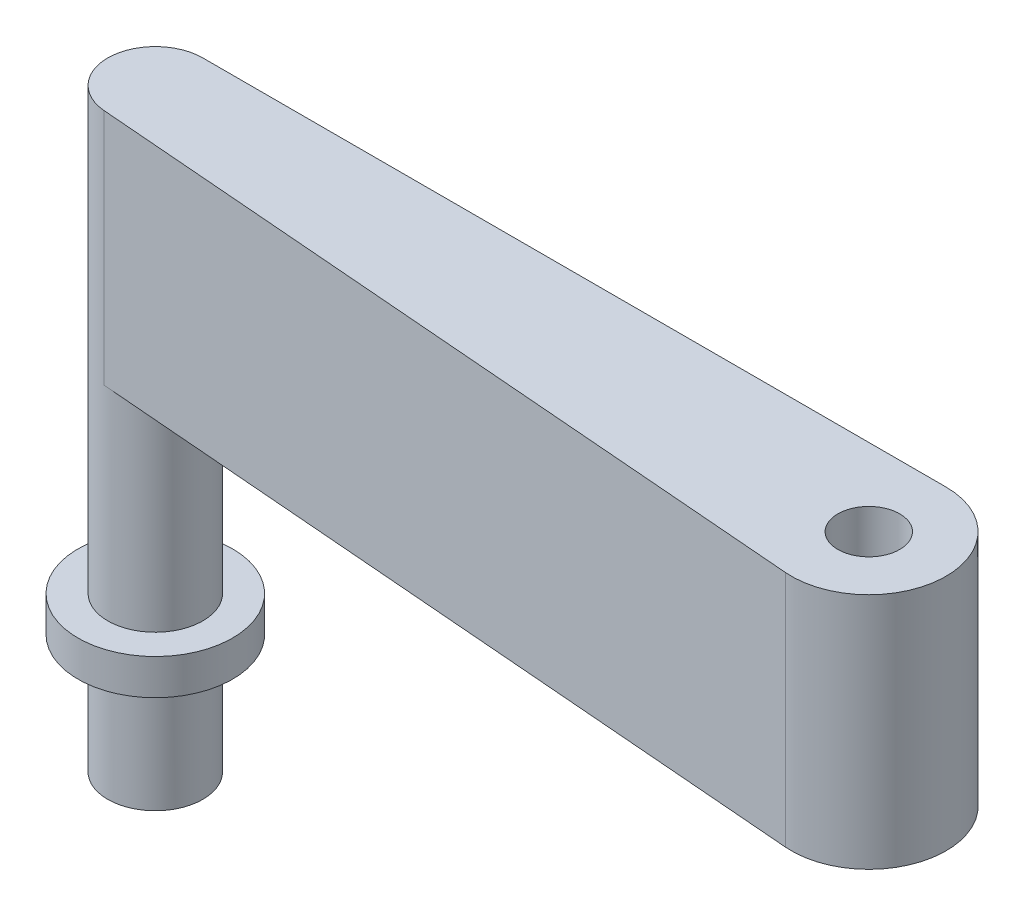
ISO-10303-21;
HEADER;
FILE_DESCRIPTION(('STEP AP214'),'2;1');
FILE_NAME('part.step','',(''),(''),'','','');
FILE_SCHEMA(('AUTOMOTIVE_DESIGN { 1 0 10303 214 1 1 1 1 }'));
ENDSEC;
DATA;
#1=APPLICATION_CONTEXT('core data for automotive mechanical design processes');
#2=APPLICATION_PROTOCOL_DEFINITION('international standard','automotive_design',2000,#1);
#3=PRODUCT_CONTEXT('',#1,'mechanical');
#4=PRODUCT('Part','Part','',(#3));
#5=PRODUCT_RELATED_PRODUCT_CATEGORY('part','',(#4));
#6=PRODUCT_DEFINITION_FORMATION('','',#4);
#7=PRODUCT_DEFINITION_CONTEXT('part definition',#1,'design');
#8=PRODUCT_DEFINITION('design','',#6,#7);
#9=PRODUCT_DEFINITION_SHAPE('','',#8);
#10=(LENGTH_UNIT() NAMED_UNIT(*) SI_UNIT(.MILLI.,.METRE.));
#11=(NAMED_UNIT(*) PLANE_ANGLE_UNIT() SI_UNIT($,.RADIAN.));
#12=(NAMED_UNIT(*) SI_UNIT($,.STERADIAN.) SOLID_ANGLE_UNIT());
#13=UNCERTAINTY_MEASURE_WITH_UNIT(LENGTH_MEASURE(1.E-05),#10,'distance_accuracy_value','');
#14=(GEOMETRIC_REPRESENTATION_CONTEXT(3) GLOBAL_UNCERTAINTY_ASSIGNED_CONTEXT((#13)) GLOBAL_UNIT_ASSIGNED_CONTEXT((#10,
#11,#12)) REPRESENTATION_CONTEXT('',''));
#15=CARTESIAN_POINT('',(0.,0.,0.));
#16=DIRECTION('',(0.,0.,1.));
#17=DIRECTION('',(1.,0.,0.));
#18=AXIS2_PLACEMENT_3D('',#15,#16,#17);
#19=CARTESIAN_POINT('',(-62.5,10.,-2.5));
#20=DIRECTION('',(0.,-1.,0.));
#21=DIRECTION('',(0.,0.,-1.));
#22=AXIS2_PLACEMENT_3D('',#19,#20,#21);
#23=CYLINDRICAL_SURFACE('',#22,4.);
#24=CARTESIAN_POINT('',(-62.5,-30.,-2.5));
#25=DIRECTION('',(0.,-1.,0.));
#26=DIRECTION('',(0.,0.,-1.));
#27=AXIS2_PLACEMENT_3D('',#24,#25,#26);
#28=CIRCLE('',#27,4.00000000000001);
#29=CARTESIAN_POINT('',(-62.5,-30.,-6.50000000000001));
#30=VERTEX_POINT('',#29);
#31=EDGE_CURVE('E134',#30,#30,#28,.T.);
#32=ORIENTED_EDGE('',*,*,#31,.T.);
#33=EDGE_LOOP('',(#32));
#34=FACE_BOUND('',#33,.T.);
#35=CARTESIAN_POINT('',(-62.5,-40.,-2.5));
#36=DIRECTION('',(0.,1.,0.));
#37=DIRECTION('',(0.,0.,1.));
#38=AXIS2_PLACEMENT_3D('',#35,#36,#37);
#39=CIRCLE('',#38,4.00000000000001);
#40=CARTESIAN_POINT('',(-62.5,-40.,1.50000000000001));
#41=VERTEX_POINT('',#40);
#42=EDGE_CURVE('E120',#41,#41,#39,.T.);
#43=ORIENTED_EDGE('',*,*,#42,.T.);
#44=EDGE_LOOP('',(#43));
#45=FACE_BOUND('',#44,.T.);
#46=ADVANCED_FACE('F35',(#34,#45),#23,.T.);
#47=CARTESIAN_POINT('',(-62.5,-40.,-2.5));
#48=DIRECTION('',(0.,1.,0.));
#49=DIRECTION('',(0.,0.,1.));
#50=AXIS2_PLACEMENT_3D('',#47,#48,#49);
#51=PLANE('',#50);
#52=CARTESIAN_POINT('',(-62.5,-40.,-2.5));
#53=DIRECTION('',(0.,-1.,0.));
#54=DIRECTION('',(0.,0.,-1.));
#55=AXIS2_PLACEMENT_3D('',#52,#53,#54);
#56=CIRCLE('',#55,2.59999999999999);
#57=CARTESIAN_POINT('',(-62.5,-40.,-5.09999999999999));
#58=VERTEX_POINT('',#57);
#59=EDGE_CURVE('E125',#58,#58,#56,.T.);
#60=ORIENTED_EDGE('',*,*,#59,.F.);
#61=EDGE_LOOP('',(#60));
#62=FACE_BOUND('',#61,.T.);
#63=ORIENTED_EDGE('',*,*,#42,.F.);
#64=EDGE_LOOP('',(#63));
#65=FACE_BOUND('',#64,.T.);
#66=ADVANCED_FACE('F159',(#62,#65),#51,.F.);
#67=CARTESIAN_POINT('',(-62.5,-30.,-2.5));
#68=DIRECTION('',(0.,-1.,0.));
#69=DIRECTION('',(0.,0.,-1.));
#70=AXIS2_PLACEMENT_3D('',#67,#68,#69);
#71=CYLINDRICAL_SURFACE('',#70,2.59999999999999);
#72=CARTESIAN_POINT('',(-62.5,-30.,-2.5));
#73=DIRECTION('',(0.,-1.,0.));
#74=DIRECTION('',(0.,0.,-1.));
#75=AXIS2_PLACEMENT_3D('',#72,#73,#74);
#76=CIRCLE('',#75,2.59999999999999);
#77=CARTESIAN_POINT('',(-62.5,-30.,-5.09999999999999));
#78=VERTEX_POINT('',#77);
#79=EDGE_CURVE('E124',#78,#78,#76,.T.);
#80=ORIENTED_EDGE('',*,*,#79,.F.);
#81=EDGE_LOOP('',(#80));
#82=FACE_BOUND('',#81,.T.);
#83=ORIENTED_EDGE('',*,*,#59,.T.);
#84=EDGE_LOOP('',(#83));
#85=FACE_BOUND('',#84,.T.);
#86=ADVANCED_FACE('F155',(#82,#85),#71,.F.);
#87=CARTESIAN_POINT('',(-62.5,-30.,-2.5));
#88=DIRECTION('',(0.,-1.,0.));
#89=DIRECTION('',(0.,0.,-1.));
#90=AXIS2_PLACEMENT_3D('',#87,#88,#89);
#91=PLANE('',#90);
#92=ORIENTED_EDGE('',*,*,#79,.T.);
#93=EDGE_LOOP('',(#92));
#94=FACE_BOUND('',#93,.T.);
#95=ADVANCED_FACE('F145',(#94),#91,.T.);
#96=CARTESIAN_POINT('',(-62.5,-30.,-2.5));
#97=DIRECTION('',(0.,-1.,0.));
#98=DIRECTION('',(0.,0.,-1.));
#99=AXIS2_PLACEMENT_3D('',#96,#97,#98);
#100=PLANE('',#99);
#101=CARTESIAN_POINT('',(-62.5,-30.,-2.5));
#102=DIRECTION('',(0.,-1.,0.));
#103=DIRECTION('',(0.,0.,-1.));
#104=AXIS2_PLACEMENT_3D('',#101,#102,#103);
#105=CIRCLE('',#104,6.50000000000001);
#106=CARTESIAN_POINT('',(-62.5,-30.,-9.00000000000001));
#107=VERTEX_POINT('',#106);
#108=EDGE_CURVE('E128',#107,#107,#105,.T.);
#109=ORIENTED_EDGE('',*,*,#108,.T.);
#110=EDGE_LOOP('',(#109));
#111=FACE_BOUND('',#110,.T.);
#112=ORIENTED_EDGE('',*,*,#31,.F.);
#113=EDGE_LOOP('',(#112));
#114=FACE_BOUND('',#113,.T.);
#115=ADVANCED_FACE('F142',(#111,#114),#100,.T.);
#116=CARTESIAN_POINT('',(-62.5,-27.,-2.5));
#117=DIRECTION('',(0.,-1.,0.));
#118=DIRECTION('',(0.,0.,-1.));
#119=AXIS2_PLACEMENT_3D('',#116,#117,#118);
#120=PLANE('',#119);
#121=CARTESIAN_POINT('',(-62.5,-27.,-2.5));
#122=DIRECTION('',(0.,-1.,0.));
#123=DIRECTION('',(0.,0.,-1.));
#124=AXIS2_PLACEMENT_3D('',#121,#122,#123);
#125=CIRCLE('',#124,6.50000000000001);
#126=CARTESIAN_POINT('',(-62.5,-27.,-9.00000000000001));
#127=VERTEX_POINT('',#126);
#128=EDGE_CURVE('E131',#127,#127,#125,.T.);
#129=ORIENTED_EDGE('',*,*,#128,.F.);
#130=EDGE_LOOP('',(#129));
#131=FACE_BOUND('',#130,.T.);
#132=CARTESIAN_POINT('',(-62.5,-27.,-2.5));
#133=DIRECTION('',(0.,-1.,0.));
#134=DIRECTION('',(0.,0.,-1.));
#135=AXIS2_PLACEMENT_3D('',#132,#133,#134);
#136=CIRCLE('',#135,4.);
#137=CARTESIAN_POINT('',(-62.5,-27.,-6.5));
#138=VERTEX_POINT('',#137);
#139=EDGE_CURVE('E11',#138,#138,#136,.T.);
#140=ORIENTED_EDGE('',*,*,#139,.T.);
#141=EDGE_LOOP('',(#140));
#142=FACE_BOUND('',#141,.T.);
#143=ADVANCED_FACE('F144',(#131,#142),#120,.F.);
#144=CARTESIAN_POINT('',(-62.5,-30.,-2.5));
#145=DIRECTION('',(0.,1.,0.));
#146=DIRECTION('',(0.,0.,1.));
#147=AXIS2_PLACEMENT_3D('',#144,#145,#146);
#148=CYLINDRICAL_SURFACE('',#147,6.50000000000001);
#149=ORIENTED_EDGE('',*,*,#108,.F.);
#150=EDGE_LOOP('',(#149));
#151=FACE_BOUND('',#150,.T.);
#152=ORIENTED_EDGE('',*,*,#128,.T.);
#153=EDGE_LOOP('',(#152));
#154=FACE_BOUND('',#153,.T.);
#155=ADVANCED_FACE('F152',(#151,#154),#148,.T.);
#156=CARTESIAN_POINT('',(0.,-10.,0.));
#157=DIRECTION('',(0.,1.,0.));
#158=DIRECTION('',(0.,0.,1.));
#159=AXIS2_PLACEMENT_3D('',#156,#157,#158);
#160=CYLINDRICAL_SURFACE('',#159,2.6);
#161=CARTESIAN_POINT('',(0.,-10.,0.));
#162=DIRECTION('',(0.,1.,0.));
#163=DIRECTION('',(0.,0.,1.));
#164=AXIS2_PLACEMENT_3D('',#161,#162,#163);
#165=CIRCLE('',#164,2.6);
#166=CARTESIAN_POINT('',(0.,-10.,2.6));
#167=VERTEX_POINT('',#166);
#168=EDGE_CURVE('E110',#167,#167,#165,.T.);
#169=ORIENTED_EDGE('',*,*,#168,.F.);
#170=EDGE_LOOP('',(#169));
#171=FACE_BOUND('',#170,.T.);
#172=CARTESIAN_POINT('',(0.,10.,0.));
#173=DIRECTION('',(0.,1.,0.));
#174=DIRECTION('',(0.,0.,1.));
#175=AXIS2_PLACEMENT_3D('',#172,#173,#174);
#176=CIRCLE('',#175,2.6);
#177=CARTESIAN_POINT('',(0.,10.,2.6));
#178=VERTEX_POINT('',#177);
#179=EDGE_CURVE('E112',#178,#178,#176,.T.);
#180=ORIENTED_EDGE('',*,*,#179,.T.);
#181=EDGE_LOOP('',(#180));
#182=FACE_BOUND('',#181,.T.);
#183=ADVANCED_FACE('F184',(#171,#182),#160,.F.);
#184=CARTESIAN_POINT('',(0.,10.,0.));
#185=DIRECTION('',(0.,-1.,0.));
#186=DIRECTION('',(0.,0.,-1.));
#187=AXIS2_PLACEMENT_3D('',#184,#185,#186);
#188=CYLINDRICAL_SURFACE('',#187,6.5);
#189=CARTESIAN_POINT('',(0.,-10.,0.));
#190=DIRECTION('',(0.,1.,0.));
#191=DIRECTION('',(0.,0.,1.));
#192=AXIS2_PLACEMENT_3D('',#189,#190,#191);
#193=CIRCLE('',#192,6.5);
#194=CARTESIAN_POINT('',(-0.519169329073482,-10.,6.47923322683706));
#195=VERTEX_POINT('',#194);
#196=CARTESIAN_POINT('',(0.,-10.,-6.5));
#197=VERTEX_POINT('',#196);
#198=EDGE_CURVE('E97',#195,#197,#193,.T.);
#199=ORIENTED_EDGE('',*,*,#198,.T.);
#200=DIRECTION('',(0.,-1.,0.));
#201=VECTOR('',#200,1.);
#202=CARTESIAN_POINT('',(0.,10.,-6.5));
#203=LINE('',#202,#201);
#204=CARTESIAN_POINT('',(0.,10.,-6.5));
#205=VERTEX_POINT('',#204);
#206=EDGE_CURVE('E89',#205,#197,#203,.T.);
#207=ORIENTED_EDGE('',*,*,#206,.F.);
#208=CARTESIAN_POINT('',(0.,10.,0.));
#209=DIRECTION('',(0.,1.,0.));
#210=DIRECTION('',(0.,0.,1.));
#211=AXIS2_PLACEMENT_3D('',#208,#209,#210);
#212=CIRCLE('',#211,6.5);
#213=CARTESIAN_POINT('',(-0.519169329073482,10.,6.47923322683706));
#214=VERTEX_POINT('',#213);
#215=EDGE_CURVE('E98',#214,#205,#212,.T.);
#216=ORIENTED_EDGE('',*,*,#215,.F.);
#217=DIRECTION('',(0.,-1.,0.));
#218=VECTOR('',#217,1.);
#219=CARTESIAN_POINT('',(-0.519169329073482,10.,6.47923322683706));
#220=LINE('',#219,#218);
#221=EDGE_CURVE('E92',#214,#195,#220,.T.);
#222=ORIENTED_EDGE('',*,*,#221,.T.);
#223=EDGE_LOOP('',(#199,#207,#216,#222));
#224=FACE_BOUND('',#223,.T.);
#225=ADVANCED_FACE('F37',(#224),#188,.T.);
#226=CARTESIAN_POINT('',(0.,10.,0.));
#227=DIRECTION('',(0.,1.,0.));
#228=DIRECTION('',(0.,0.,1.));
#229=AXIS2_PLACEMENT_3D('',#226,#227,#228);
#230=PLANE('',#229);
#231=ORIENTED_EDGE('',*,*,#179,.F.);
#232=EDGE_LOOP('',(#231));
#233=FACE_BOUND('',#232,.T.);
#234=ORIENTED_EDGE('',*,*,#215,.T.);
#235=DIRECTION('',(-1.,0.,0.));
#236=VECTOR('',#235,1.);
#237=CARTESIAN_POINT('',(-62.5,10.,-6.5));
#238=LINE('',#237,#236);
#239=CARTESIAN_POINT('',(-62.5,10.,-6.5));
#240=VERTEX_POINT('',#239);
#241=EDGE_CURVE('E79',#205,#240,#238,.T.);
#242=ORIENTED_EDGE('',*,*,#241,.T.);
#243=CARTESIAN_POINT('',(-62.5,10.,-2.5));
#244=DIRECTION('',(0.,1.,0.));
#245=DIRECTION('',(0.,0.,1.));
#246=AXIS2_PLACEMENT_3D('',#243,#244,#245);
#247=CIRCLE('',#246,4.);
#248=CARTESIAN_POINT('',(-62.8194888178914,10.,1.48722044728435));
#249=VERTEX_POINT('',#248);
#250=EDGE_CURVE('E116',#240,#249,#247,.T.);
#251=ORIENTED_EDGE('',*,*,#250,.T.);
#252=DIRECTION('',(0.996805111821086,0.,0.0798722044728435));
#253=VECTOR('',#252,1.);
#254=CARTESIAN_POINT('',(-62.8194888178914,10.,1.48722044728435));
#255=LINE('',#254,#253);
#256=EDGE_CURVE('E52',#249,#214,#255,.T.);
#257=ORIENTED_EDGE('',*,*,#256,.T.);
#258=EDGE_LOOP('',(#234,#242,#251,#257));
#259=FACE_BOUND('',#258,.T.);
#260=ADVANCED_FACE('F179',(#233,#259),#230,.T.);
#261=CARTESIAN_POINT('',(-62.8194888178914,10.,1.48722044728435));
#262=DIRECTION('',(0.0798722044728435,0.,-0.996805111821086));
#263=DIRECTION('',(-0.996805111821086,0.,-0.0798722044728435));
#264=AXIS2_PLACEMENT_3D('',#261,#262,#263);
#265=PLANE('',#264);
#266=DIRECTION('',(0.996805111821086,0.,0.0798722044728435));
#267=VECTOR('',#266,1.);
#268=CARTESIAN_POINT('',(-62.8194888178914,-10.,1.48722044728435));
#269=LINE('',#268,#267);
#270=CARTESIAN_POINT('',(-62.8194888178914,-10.,1.48722044728435));
#271=VERTEX_POINT('',#270);
#272=EDGE_CURVE('E71',#271,#195,#269,.T.);
#273=ORIENTED_EDGE('',*,*,#272,.T.);
#274=ORIENTED_EDGE('',*,*,#221,.F.);
#275=ORIENTED_EDGE('',*,*,#256,.F.);
#276=DIRECTION('',(0.,-1.,0.));
#277=VECTOR('',#276,1.);
#278=CARTESIAN_POINT('',(-62.8194888178914,10.,1.48722044728435));
#279=LINE('',#278,#277);
#280=EDGE_CURVE('E87',#249,#271,#279,.T.);
#281=ORIENTED_EDGE('',*,*,#280,.T.);
#282=EDGE_LOOP('',(#273,#274,#275,#281));
#283=FACE_BOUND('',#282,.T.);
#284=ADVANCED_FACE('F91',(#283),#265,.F.);
#285=CARTESIAN_POINT('',(0.,-10.,0.));
#286=DIRECTION('',(0.,1.,0.));
#287=DIRECTION('',(0.,0.,1.));
#288=AXIS2_PLACEMENT_3D('',#285,#286,#287);
#289=PLANE('',#288);
#290=ORIENTED_EDGE('',*,*,#168,.T.);
#291=EDGE_LOOP('',(#290));
#292=FACE_BOUND('',#291,.T.);
#293=ORIENTED_EDGE('',*,*,#272,.F.);
#294=CARTESIAN_POINT('',(-62.5,-10.,-2.5));
#295=DIRECTION('',(0.,1.,0.));
#296=DIRECTION('',(0.,0.,1.));
#297=AXIS2_PLACEMENT_3D('',#294,#295,#296);
#298=CIRCLE('',#297,4.00000000000001);
#299=CARTESIAN_POINT('',(-62.5,-10.,-6.5));
#300=VERTEX_POINT('',#299);
#301=EDGE_CURVE('E44',#271,#300,#298,.T.);
#302=ORIENTED_EDGE('',*,*,#301,.T.);
#303=DIRECTION('',(-1.,0.,0.));
#304=VECTOR('',#303,1.);
#305=CARTESIAN_POINT('',(-62.5,-10.,-6.5));
#306=LINE('',#305,#304);
#307=EDGE_CURVE('E99',#197,#300,#306,.T.);
#308=ORIENTED_EDGE('',*,*,#307,.F.);
#309=ORIENTED_EDGE('',*,*,#198,.F.);
#310=EDGE_LOOP('',(#293,#302,#308,#309));
#311=FACE_BOUND('',#310,.T.);
#312=ADVANCED_FACE('F95',(#292,#311),#289,.F.);
#313=CARTESIAN_POINT('',(-62.5,10.,-6.5));
#314=DIRECTION('',(0.,0.,1.));
#315=DIRECTION('',(1.,0.,0.));
#316=AXIS2_PLACEMENT_3D('',#313,#314,#315);
#317=PLANE('',#316);
#318=ORIENTED_EDGE('',*,*,#307,.T.);
#319=DIRECTION('',(0.,-1.,0.));
#320=VECTOR('',#319,1.);
#321=CARTESIAN_POINT('',(-62.5,10.,-6.5));
#322=LINE('',#321,#320);
#323=EDGE_CURVE('E88',#240,#300,#322,.T.);
#324=ORIENTED_EDGE('',*,*,#323,.F.);
#325=ORIENTED_EDGE('',*,*,#241,.F.);
#326=ORIENTED_EDGE('',*,*,#206,.T.);
#327=EDGE_LOOP('',(#318,#324,#325,#326));
#328=FACE_BOUND('',#327,.T.);
#329=ADVANCED_FACE('F107',(#328),#317,.F.);
#330=ORIENTED_EDGE('',*,*,#323,.T.);
#331=ORIENTED_EDGE('',*,*,#301,.F.);
#332=ORIENTED_EDGE('',*,*,#280,.F.);
#333=ORIENTED_EDGE('',*,*,#250,.F.);
#334=EDGE_LOOP('',(#330,#331,#332,#333));
#335=FACE_BOUND('',#334,.T.);
#336=ORIENTED_EDGE('',*,*,#139,.F.);
#337=EDGE_LOOP('',(#336));
#338=FACE_BOUND('',#337,.T.);
#339=ADVANCED_FACE('F84',(#335,#338),#23,.T.);
#340=CLOSED_SHELL('',(#46,#66,#86,#95,#115,#143,#155,#183,#225,#260,#284,#312,#329,#339));
#341=MANIFOLD_SOLID_BREP('B2',#340);
#342=ADVANCED_BREP_SHAPE_REPRESENTATION('',(#18,#341),#14);
#343=SHAPE_DEFINITION_REPRESENTATION(#9,#342);
ENDSEC;
END-ISO-10303-21;
